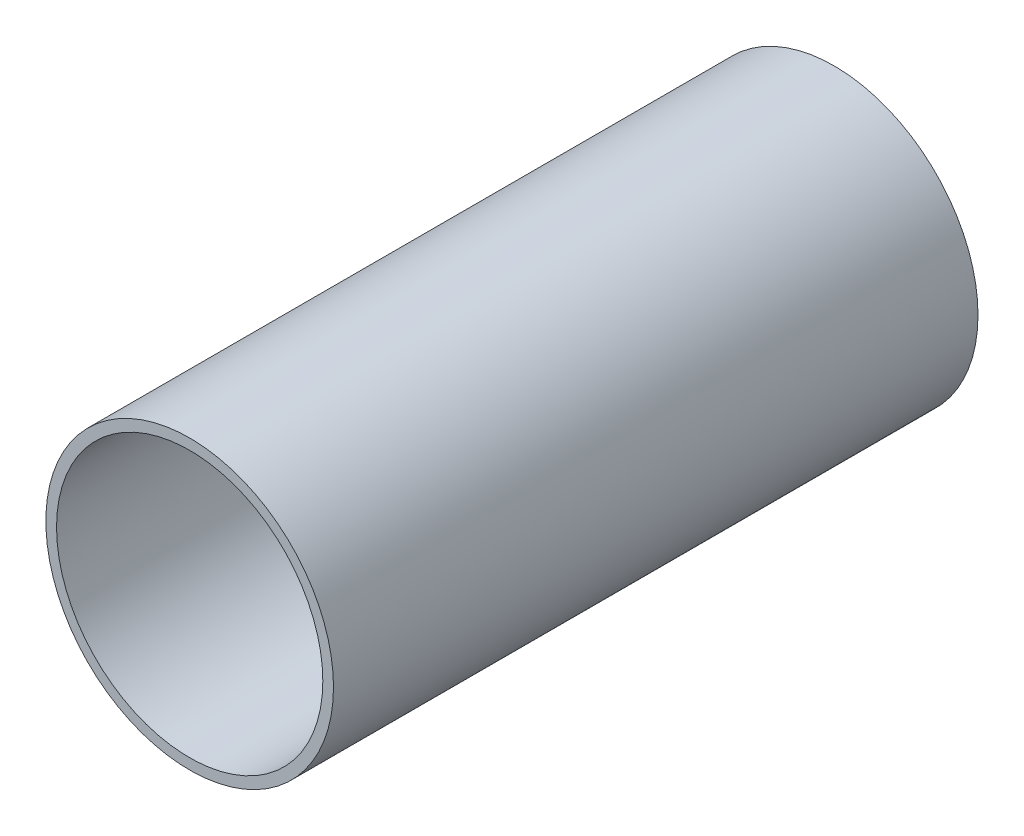
ISO-10303-21;
HEADER;
FILE_DESCRIPTION(('STEP AP214'),'2;1');
FILE_NAME('part.step','',(''),(''),'','','');
FILE_SCHEMA(('AUTOMOTIVE_DESIGN { 1 0 10303 214 1 1 1 1 }'));
ENDSEC;
DATA;
#1=APPLICATION_CONTEXT('core data for automotive mechanical design processes');
#2=APPLICATION_PROTOCOL_DEFINITION('international standard','automotive_design',2000,#1);
#3=PRODUCT_CONTEXT('',#1,'mechanical');
#4=PRODUCT('Part','Part','',(#3));
#5=PRODUCT_RELATED_PRODUCT_CATEGORY('part','',(#4));
#6=PRODUCT_DEFINITION_FORMATION('','',#4);
#7=PRODUCT_DEFINITION_CONTEXT('part definition',#1,'design');
#8=PRODUCT_DEFINITION('design','',#6,#7);
#9=PRODUCT_DEFINITION_SHAPE('','',#8);
#10=(LENGTH_UNIT() NAMED_UNIT(*) SI_UNIT(.MILLI.,.METRE.));
#11=(NAMED_UNIT(*) PLANE_ANGLE_UNIT() SI_UNIT($,.RADIAN.));
#12=(NAMED_UNIT(*) SI_UNIT($,.STERADIAN.) SOLID_ANGLE_UNIT());
#13=UNCERTAINTY_MEASURE_WITH_UNIT(LENGTH_MEASURE(1.E-05),#10,'distance_accuracy_value','');
#14=(GEOMETRIC_REPRESENTATION_CONTEXT(3) GLOBAL_UNCERTAINTY_ASSIGNED_CONTEXT((#13)) GLOBAL_UNIT_ASSIGNED_CONTEXT((#10,
#11,#12)) REPRESENTATION_CONTEXT('',''));
#15=CARTESIAN_POINT('',(0.,0.,0.));
#16=DIRECTION('',(0.,0.,1.));
#17=DIRECTION('',(1.,0.,0.));
#18=AXIS2_PLACEMENT_3D('',#15,#16,#17);
#19=CARTESIAN_POINT('',(0.,0.,910.599999999999));
#20=DIRECTION('',(0.,0.,1.));
#21=DIRECTION('',(1.,0.,0.));
#22=AXIS2_PLACEMENT_3D('',#19,#20,#21);
#23=PLANE('',#22);
#24=CARTESIAN_POINT('',(0.,0.,910.599999999999));
#25=DIRECTION('',(0.,0.,1.));
#26=DIRECTION('',(1.,0.,0.));
#27=AXIS2_PLACEMENT_3D('',#24,#25,#26);
#28=CIRCLE('',#27,203.2);
#29=CARTESIAN_POINT('',(203.2,0.,910.599999999999));
#30=VERTEX_POINT('',#29);
#31=EDGE_CURVE('E10',#30,#30,#28,.T.);
#32=ORIENTED_EDGE('',*,*,#31,.T.);
#33=EDGE_LOOP('',(#32));
#34=FACE_BOUND('',#33,.T.);
#35=CARTESIAN_POINT('',(0.,0.,910.599999999999));
#36=DIRECTION('',(0.,0.,1.));
#37=DIRECTION('',(1.,0.,0.));
#38=AXIS2_PLACEMENT_3D('',#35,#36,#37);
#39=CIRCLE('',#38,188.1124);
#40=CARTESIAN_POINT('',(188.1124,0.,910.599999999999));
#41=VERTEX_POINT('',#40);
#42=EDGE_CURVE('E39',#41,#41,#39,.T.);
#43=ORIENTED_EDGE('',*,*,#42,.F.);
#44=EDGE_LOOP('',(#43));
#45=FACE_BOUND('',#44,.T.);
#46=ADVANCED_FACE('F28',(#34,#45),#23,.T.);
#47=CARTESIAN_POINT('',(0.,0.,0.));
#48=DIRECTION('',(0.,0.,1.));
#49=DIRECTION('',(1.,0.,0.));
#50=AXIS2_PLACEMENT_3D('',#47,#48,#49);
#51=PLANE('',#50);
#52=CARTESIAN_POINT('',(0.,0.,0.));
#53=DIRECTION('',(0.,0.,1.));
#54=DIRECTION('',(1.,0.,0.));
#55=AXIS2_PLACEMENT_3D('',#52,#53,#54);
#56=CIRCLE('',#55,203.2);
#57=CARTESIAN_POINT('',(203.2,0.,0.));
#58=VERTEX_POINT('',#57);
#59=EDGE_CURVE('E32',#58,#58,#56,.T.);
#60=ORIENTED_EDGE('',*,*,#59,.F.);
#61=EDGE_LOOP('',(#60));
#62=FACE_BOUND('',#61,.T.);
#63=CARTESIAN_POINT('',(0.,0.,0.));
#64=DIRECTION('',(0.,0.,1.));
#65=DIRECTION('',(1.,0.,0.));
#66=AXIS2_PLACEMENT_3D('',#63,#64,#65);
#67=CIRCLE('',#66,188.1124);
#68=CARTESIAN_POINT('',(188.1124,0.,0.));
#69=VERTEX_POINT('',#68);
#70=EDGE_CURVE('E41',#69,#69,#67,.T.);
#71=ORIENTED_EDGE('',*,*,#70,.T.);
#72=EDGE_LOOP('',(#71));
#73=FACE_BOUND('',#72,.T.);
#74=ADVANCED_FACE('F51',(#62,#73),#51,.F.);
#75=CARTESIAN_POINT('',(0.,0.,910.599999999999));
#76=DIRECTION('',(0.,0.,-1.));
#77=DIRECTION('',(-1.,0.,0.));
#78=AXIS2_PLACEMENT_3D('',#75,#76,#77);
#79=CYLINDRICAL_SURFACE('',#78,203.2);
#80=ORIENTED_EDGE('',*,*,#31,.F.);
#81=EDGE_LOOP('',(#80));
#82=FACE_BOUND('',#81,.T.);
#83=ORIENTED_EDGE('',*,*,#59,.T.);
#84=EDGE_LOOP('',(#83));
#85=FACE_BOUND('',#84,.T.);
#86=ADVANCED_FACE('F30',(#82,#85),#79,.T.);
#87=CARTESIAN_POINT('',(0.,0.,910.599999999999));
#88=DIRECTION('',(0.,0.,-1.));
#89=DIRECTION('',(-1.,0.,0.));
#90=AXIS2_PLACEMENT_3D('',#87,#88,#89);
#91=CYLINDRICAL_SURFACE('',#90,188.1124);
#92=ORIENTED_EDGE('',*,*,#42,.T.);
#93=EDGE_LOOP('',(#92));
#94=FACE_BOUND('',#93,.T.);
#95=ORIENTED_EDGE('',*,*,#70,.F.);
#96=EDGE_LOOP('',(#95));
#97=FACE_BOUND('',#96,.T.);
#98=ADVANCED_FACE('F47',(#94,#97),#91,.F.);
#99=CLOSED_SHELL('',(#46,#74,#86,#98));
#100=MANIFOLD_SOLID_BREP('B2',#99);
#101=ADVANCED_BREP_SHAPE_REPRESENTATION('',(#18,#100),#14);
#102=SHAPE_DEFINITION_REPRESENTATION(#9,#101);
ENDSEC;
END-ISO-10303-21;
